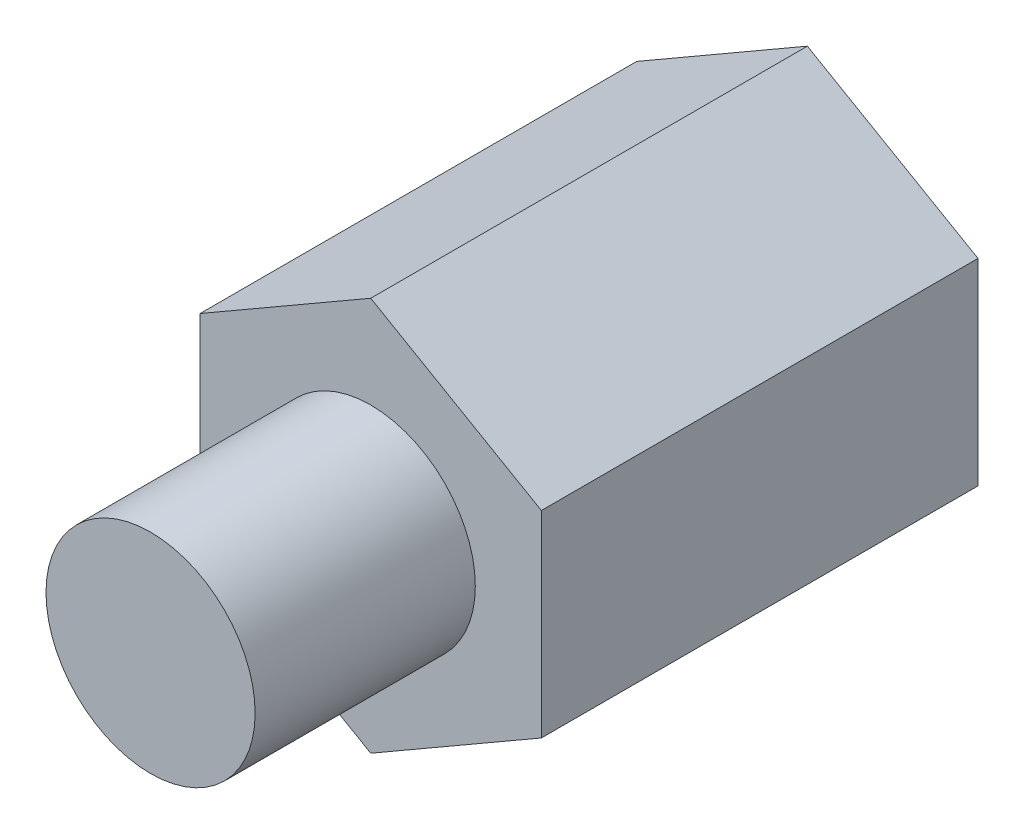
ISO-10303-21;
HEADER;
FILE_DESCRIPTION(('STEP AP214'),'2;1');
FILE_NAME('part.step','',(''),(''),'','','');
FILE_SCHEMA(('AUTOMOTIVE_DESIGN { 1 0 10303 214 1 1 1 1 }'));
ENDSEC;
DATA;
#1=APPLICATION_CONTEXT('core data for automotive mechanical design processes');
#2=APPLICATION_PROTOCOL_DEFINITION('international standard','automotive_design',2000,#1);
#3=PRODUCT_CONTEXT('',#1,'mechanical');
#4=PRODUCT('Part','Part','',(#3));
#5=PRODUCT_RELATED_PRODUCT_CATEGORY('part','',(#4));
#6=PRODUCT_DEFINITION_FORMATION('','',#4);
#7=PRODUCT_DEFINITION_CONTEXT('part definition',#1,'design');
#8=PRODUCT_DEFINITION('design','',#6,#7);
#9=PRODUCT_DEFINITION_SHAPE('','',#8);
#10=(LENGTH_UNIT() NAMED_UNIT(*) SI_UNIT(.MILLI.,.METRE.));
#11=(NAMED_UNIT(*) PLANE_ANGLE_UNIT() SI_UNIT($,.RADIAN.));
#12=(NAMED_UNIT(*) SI_UNIT($,.STERADIAN.) SOLID_ANGLE_UNIT());
#13=UNCERTAINTY_MEASURE_WITH_UNIT(LENGTH_MEASURE(1.E-05),#10,'distance_accuracy_value','');
#14=(GEOMETRIC_REPRESENTATION_CONTEXT(3) GLOBAL_UNCERTAINTY_ASSIGNED_CONTEXT((#13)) GLOBAL_UNIT_ASSIGNED_CONTEXT((#10,
#11,#12)) REPRESENTATION_CONTEXT('',''));
#15=CARTESIAN_POINT('',(0.,0.,0.));
#16=DIRECTION('',(0.,0.,1.));
#17=DIRECTION('',(1.,0.,0.));
#18=AXIS2_PLACEMENT_3D('',#15,#16,#17);
#19=CARTESIAN_POINT('',(0.,0.,5.95));
#20=DIRECTION('',(0.,0.,1.));
#21=DIRECTION('',(1.,0.,0.));
#22=AXIS2_PLACEMENT_3D('',#19,#20,#21);
#23=PLANE('',#22);
#24=CARTESIAN_POINT('',(0.,0.,5.95));
#25=DIRECTION('',(0.,0.,1.));
#26=DIRECTION('',(1.,0.,0.));
#27=AXIS2_PLACEMENT_3D('',#24,#25,#26);
#28=CIRCLE('',#27,1.425);
#29=CARTESIAN_POINT('',(1.425,0.,5.95));
#30=VERTEX_POINT('',#29);
#31=EDGE_CURVE('E185',#30,#30,#28,.T.);
#32=ORIENTED_EDGE('',*,*,#31,.F.);
#33=EDGE_LOOP('',(#32));
#34=FACE_BOUND('',#33,.T.);
#35=DIRECTION('',(0.866025403784441,-0.499999999999995,0.));
#36=VECTOR('',#35,1.);
#37=CARTESIAN_POINT('',(-2.32499999999999,-1.34233937586591,5.95));
#38=LINE('',#37,#36);
#39=CARTESIAN_POINT('',(-2.32499999999999,-1.34233937586591,5.95));
#40=VERTEX_POINT('',#39);
#41=CARTESIAN_POINT('',(0.,-2.68467875173176,5.95));
#42=VERTEX_POINT('',#41);
#43=EDGE_CURVE('E131',#40,#42,#38,.T.);
#44=ORIENTED_EDGE('',*,*,#43,.T.);
#45=DIRECTION('',(0.866025403784438,0.500000000000001,0.));
#46=VECTOR('',#45,1.);
#47=CARTESIAN_POINT('',(0.,-2.68467875173176,5.95));
#48=LINE('',#47,#46);
#49=CARTESIAN_POINT('',(2.32500000000001,-1.34233937586588,5.95));
#50=VERTEX_POINT('',#49);
#51=EDGE_CURVE('E90',#42,#50,#48,.T.);
#52=ORIENTED_EDGE('',*,*,#51,.T.);
#53=DIRECTION('',(0.,1.,0.));
#54=VECTOR('',#53,1.);
#55=CARTESIAN_POINT('',(2.32500000000001,-1.34233937586588,5.95));
#56=LINE('',#55,#54);
#57=CARTESIAN_POINT('',(2.325,1.34233937586589,5.95));
#58=VERTEX_POINT('',#57);
#59=EDGE_CURVE('E102',#50,#58,#56,.T.);
#60=ORIENTED_EDGE('',*,*,#59,.T.);
#61=DIRECTION('',(-0.866025403784442,0.499999999999995,0.));
#62=VECTOR('',#61,1.);
#63=CARTESIAN_POINT('',(2.325,1.34233937586589,5.95));
#64=LINE('',#63,#62);
#65=CARTESIAN_POINT('',(0.,2.68467875173176,5.95));
#66=VERTEX_POINT('',#65);
#67=EDGE_CURVE('E97',#58,#66,#64,.T.);
#68=ORIENTED_EDGE('',*,*,#67,.T.);
#69=DIRECTION('',(-0.866025403784435,-0.500000000000007,0.));
#70=VECTOR('',#69,1.);
#71=CARTESIAN_POINT('',(0.,2.68467875173176,5.95));
#72=LINE('',#71,#70);
#73=CARTESIAN_POINT('',(-2.32500000000001,1.34233937586586,5.95));
#74=VERTEX_POINT('',#73);
#75=EDGE_CURVE('E100',#66,#74,#72,.T.);
#76=ORIENTED_EDGE('',*,*,#75,.T.);
#77=DIRECTION('',(0.,-1.,0.));
#78=VECTOR('',#77,1.);
#79=CARTESIAN_POINT('',(-2.32500000000001,1.34233937586586,5.95));
#80=LINE('',#79,#78);
#81=EDGE_CURVE('E53',#74,#40,#80,.T.);
#82=ORIENTED_EDGE('',*,*,#81,.T.);
#83=EDGE_LOOP('',(#44,#52,#60,#68,#76,#82));
#84=FACE_BOUND('',#83,.T.);
#85=ADVANCED_FACE('F36',(#34,#84),#23,.T.);
#86=CARTESIAN_POINT('',(0.,0.,0.));
#87=DIRECTION('',(0.,0.,1.));
#88=DIRECTION('',(1.,0.,0.));
#89=AXIS2_PLACEMENT_3D('',#86,#87,#88);
#90=PLANE('',#89);
#91=DIRECTION('',(0.866025403784441,-0.499999999999995,0.));
#92=VECTOR('',#91,1.);
#93=CARTESIAN_POINT('',(-2.32499999999999,-1.34233937586591,0.));
#94=LINE('',#93,#92);
#95=CARTESIAN_POINT('',(-2.32499999999999,-1.34233937586591,0.));
#96=VERTEX_POINT('',#95);
#97=CARTESIAN_POINT('',(0.,-2.68467875173176,0.));
#98=VERTEX_POINT('',#97);
#99=EDGE_CURVE('E120',#96,#98,#94,.T.);
#100=ORIENTED_EDGE('',*,*,#99,.F.);
#101=DIRECTION('',(0.,-1.,0.));
#102=VECTOR('',#101,1.);
#103=CARTESIAN_POINT('',(-2.32500000000001,1.34233937586586,0.));
#104=LINE('',#103,#102);
#105=CARTESIAN_POINT('',(-2.32500000000001,1.34233937586586,0.));
#106=VERTEX_POINT('',#105);
#107=EDGE_CURVE('E82',#106,#96,#104,.T.);
#108=ORIENTED_EDGE('',*,*,#107,.F.);
#109=DIRECTION('',(-0.866025403784435,-0.500000000000007,0.));
#110=VECTOR('',#109,1.);
#111=CARTESIAN_POINT('',(0.,2.68467875173176,0.));
#112=LINE('',#111,#110);
#113=CARTESIAN_POINT('',(0.,2.68467875173176,0.));
#114=VERTEX_POINT('',#113);
#115=EDGE_CURVE('E76',#114,#106,#112,.T.);
#116=ORIENTED_EDGE('',*,*,#115,.F.);
#117=DIRECTION('',(-0.866025403784442,0.499999999999995,0.));
#118=VECTOR('',#117,1.);
#119=CARTESIAN_POINT('',(2.325,1.34233937586589,0.));
#120=LINE('',#119,#118);
#121=CARTESIAN_POINT('',(2.325,1.34233937586589,0.));
#122=VERTEX_POINT('',#121);
#123=EDGE_CURVE('E110',#122,#114,#120,.T.);
#124=ORIENTED_EDGE('',*,*,#123,.F.);
#125=DIRECTION('',(0.,1.,0.));
#126=VECTOR('',#125,1.);
#127=CARTESIAN_POINT('',(2.32500000000001,-1.34233937586588,0.));
#128=LINE('',#127,#126);
#129=CARTESIAN_POINT('',(2.32500000000001,-1.34233937586588,0.));
#130=VERTEX_POINT('',#129);
#131=EDGE_CURVE('E126',#130,#122,#128,.T.);
#132=ORIENTED_EDGE('',*,*,#131,.F.);
#133=DIRECTION('',(0.866025403784438,0.500000000000001,0.));
#134=VECTOR('',#133,1.);
#135=CARTESIAN_POINT('',(0.,-2.68467875173176,0.));
#136=LINE('',#135,#134);
#137=EDGE_CURVE('E123',#98,#130,#136,.T.);
#138=ORIENTED_EDGE('',*,*,#137,.F.);
#139=EDGE_LOOP('',(#100,#108,#116,#124,#132,#138));
#140=FACE_BOUND('',#139,.T.);
#141=CARTESIAN_POINT('',(0.,0.,0.));
#142=DIRECTION('',(0.,0.,1.));
#143=DIRECTION('',(1.,0.,0.));
#144=AXIS2_PLACEMENT_3D('',#141,#142,#143);
#145=CIRCLE('',#144,1.2);
#146=CARTESIAN_POINT('',(1.2,0.,0.));
#147=VERTEX_POINT('',#146);
#148=EDGE_CURVE('E124',#147,#147,#145,.T.);
#149=ORIENTED_EDGE('',*,*,#148,.T.);
#150=EDGE_LOOP('',(#149));
#151=FACE_BOUND('',#150,.T.);
#152=ADVANCED_FACE('F140',(#140,#151),#90,.F.);
#153=CARTESIAN_POINT('',(-2.32499999999999,-1.34233937586591,5.95));
#154=DIRECTION('',(0.499999999999995,0.866025403784442,0.));
#155=DIRECTION('',(-0.866025403784442,0.499999999999995,0.));
#156=AXIS2_PLACEMENT_3D('',#153,#154,#155);
#157=PLANE('',#156);
#158=ORIENTED_EDGE('',*,*,#99,.T.);
#159=DIRECTION('',(0.,0.,-1.));
#160=VECTOR('',#159,1.);
#161=CARTESIAN_POINT('',(0.,-2.68467875173176,5.95));
#162=LINE('',#161,#160);
#163=EDGE_CURVE('E11',#42,#98,#162,.T.);
#164=ORIENTED_EDGE('',*,*,#163,.F.);
#165=ORIENTED_EDGE('',*,*,#43,.F.);
#166=DIRECTION('',(0.,0.,-1.));
#167=VECTOR('',#166,1.);
#168=CARTESIAN_POINT('',(-2.32499999999999,-1.34233937586591,5.95));
#169=LINE('',#168,#167);
#170=EDGE_CURVE('E116',#40,#96,#169,.T.);
#171=ORIENTED_EDGE('',*,*,#170,.T.);
#172=EDGE_LOOP('',(#158,#164,#165,#171));
#173=FACE_BOUND('',#172,.T.);
#174=ADVANCED_FACE('F38',(#173),#157,.F.);
#175=CARTESIAN_POINT('',(0.,-2.68467875173176,5.95));
#176=DIRECTION('',(-0.500000000000001,0.866025403784438,0.));
#177=DIRECTION('',(-0.866025403784438,-0.500000000000001,0.));
#178=AXIS2_PLACEMENT_3D('',#175,#176,#177);
#179=PLANE('',#178);
#180=ORIENTED_EDGE('',*,*,#137,.T.);
#181=DIRECTION('',(0.,0.,-1.));
#182=VECTOR('',#181,1.);
#183=CARTESIAN_POINT('',(2.32500000000001,-1.34233937586588,5.95));
#184=LINE('',#183,#182);
#185=EDGE_CURVE('E45',#50,#130,#184,.T.);
#186=ORIENTED_EDGE('',*,*,#185,.F.);
#187=ORIENTED_EDGE('',*,*,#51,.F.);
#188=ORIENTED_EDGE('',*,*,#163,.T.);
#189=EDGE_LOOP('',(#180,#186,#187,#188));
#190=FACE_BOUND('',#189,.T.);
#191=ADVANCED_FACE('F253',(#190),#179,.F.);
#192=CARTESIAN_POINT('',(2.32500000000001,-1.34233937586588,5.95));
#193=DIRECTION('',(-1.,0.,0.));
#194=DIRECTION('',(0.,-1.,0.));
#195=AXIS2_PLACEMENT_3D('',#192,#193,#194);
#196=PLANE('',#195);
#197=ORIENTED_EDGE('',*,*,#131,.T.);
#198=DIRECTION('',(0.,0.,-1.));
#199=VECTOR('',#198,1.);
#200=CARTESIAN_POINT('',(2.325,1.34233937586589,5.95));
#201=LINE('',#200,#199);
#202=EDGE_CURVE('E111',#58,#122,#201,.T.);
#203=ORIENTED_EDGE('',*,*,#202,.F.);
#204=ORIENTED_EDGE('',*,*,#59,.F.);
#205=ORIENTED_EDGE('',*,*,#185,.T.);
#206=EDGE_LOOP('',(#197,#203,#204,#205));
#207=FACE_BOUND('',#206,.T.);
#208=ADVANCED_FACE('F137',(#207),#196,.F.);
#209=CARTESIAN_POINT('',(2.325,1.34233937586589,5.95));
#210=DIRECTION('',(-0.499999999999995,-0.866025403784442,0.));
#211=DIRECTION('',(0.866025403784442,-0.499999999999995,0.));
#212=AXIS2_PLACEMENT_3D('',#209,#210,#211);
#213=PLANE('',#212);
#214=ORIENTED_EDGE('',*,*,#123,.T.);
#215=DIRECTION('',(0.,0.,-1.));
#216=VECTOR('',#215,1.);
#217=CARTESIAN_POINT('',(0.,2.68467875173176,5.95));
#218=LINE('',#217,#216);
#219=EDGE_CURVE('E107',#66,#114,#218,.T.);
#220=ORIENTED_EDGE('',*,*,#219,.F.);
#221=ORIENTED_EDGE('',*,*,#67,.F.);
#222=ORIENTED_EDGE('',*,*,#202,.T.);
#223=EDGE_LOOP('',(#214,#220,#221,#222));
#224=FACE_BOUND('',#223,.T.);
#225=ADVANCED_FACE('F108',(#224),#213,.F.);
#226=CARTESIAN_POINT('',(0.,2.68467875173176,5.95));
#227=DIRECTION('',(0.500000000000007,-0.866025403784435,0.));
#228=DIRECTION('',(0.866025403784435,0.500000000000007,0.));
#229=AXIS2_PLACEMENT_3D('',#226,#227,#228);
#230=PLANE('',#229);
#231=ORIENTED_EDGE('',*,*,#115,.T.);
#232=DIRECTION('',(0.,0.,-1.));
#233=VECTOR('',#232,1.);
#234=CARTESIAN_POINT('',(-2.32500000000001,1.34233937586586,5.95));
#235=LINE('',#234,#233);
#236=EDGE_CURVE('E112',#74,#106,#235,.T.);
#237=ORIENTED_EDGE('',*,*,#236,.F.);
#238=ORIENTED_EDGE('',*,*,#75,.F.);
#239=ORIENTED_EDGE('',*,*,#219,.T.);
#240=EDGE_LOOP('',(#231,#237,#238,#239));
#241=FACE_BOUND('',#240,.T.);
#242=ADVANCED_FACE('F114',(#241),#230,.F.);
#243=CARTESIAN_POINT('',(-2.32500000000001,1.34233937586586,5.95));
#244=DIRECTION('',(1.,0.,0.));
#245=DIRECTION('',(0.,1.,0.));
#246=AXIS2_PLACEMENT_3D('',#243,#244,#245);
#247=PLANE('',#246);
#248=ORIENTED_EDGE('',*,*,#107,.T.);
#249=ORIENTED_EDGE('',*,*,#170,.F.);
#250=ORIENTED_EDGE('',*,*,#81,.F.);
#251=ORIENTED_EDGE('',*,*,#236,.T.);
#252=EDGE_LOOP('',(#248,#249,#250,#251));
#253=FACE_BOUND('',#252,.T.);
#254=ADVANCED_FACE('F145',(#253),#247,.F.);
#255=CARTESIAN_POINT('',(0.,0.,5.95));
#256=DIRECTION('',(0.,0.,-1.));
#257=DIRECTION('',(-1.,0.,0.));
#258=AXIS2_PLACEMENT_3D('',#255,#256,#257);
#259=CYLINDRICAL_SURFACE('',#258,1.2);
#260=CARTESIAN_POINT('',(0.,0.,5.95));
#261=DIRECTION('',(0.,0.,1.));
#262=DIRECTION('',(1.,0.,0.));
#263=AXIS2_PLACEMENT_3D('',#260,#261,#262);
#264=CIRCLE('',#263,1.2);
#265=CARTESIAN_POINT('',(1.2,0.,5.95));
#266=VERTEX_POINT('',#265);
#267=EDGE_CURVE('E184',#266,#266,#264,.T.);
#268=ORIENTED_EDGE('',*,*,#267,.T.);
#269=EDGE_LOOP('',(#268));
#270=FACE_BOUND('',#269,.T.);
#271=ORIENTED_EDGE('',*,*,#148,.F.);
#272=EDGE_LOOP('',(#271));
#273=FACE_BOUND('',#272,.T.);
#274=ADVANCED_FACE('F147',(#270,#273),#259,.F.);
#275=CARTESIAN_POINT('',(0.,0.,5.95));
#276=DIRECTION('',(0.,0.,1.));
#277=DIRECTION('',(1.,0.,0.));
#278=AXIS2_PLACEMENT_3D('',#275,#276,#277);
#279=PLANE('',#278);
#280=ORIENTED_EDGE('',*,*,#267,.F.);
#281=EDGE_LOOP('',(#280));
#282=FACE_BOUND('',#281,.T.);
#283=ADVANCED_FACE('F154',(#282),#279,.F.);
#284=CARTESIAN_POINT('',(0.,0.,8.95));
#285=DIRECTION('',(0.,0.,-1.));
#286=DIRECTION('',(-1.,0.,0.));
#287=AXIS2_PLACEMENT_3D('',#284,#285,#286);
#288=CYLINDRICAL_SURFACE('',#287,1.425);
#289=CARTESIAN_POINT('',(0.,0.,8.95));
#290=DIRECTION('',(0.,0.,1.));
#291=DIRECTION('',(1.,0.,0.));
#292=AXIS2_PLACEMENT_3D('',#289,#290,#291);
#293=CIRCLE('',#292,1.425);
#294=CARTESIAN_POINT('',(1.425,0.,8.95));
#295=VERTEX_POINT('',#294);
#296=EDGE_CURVE('E183',#295,#295,#293,.T.);
#297=ORIENTED_EDGE('',*,*,#296,.F.);
#298=EDGE_LOOP('',(#297));
#299=FACE_BOUND('',#298,.T.);
#300=ORIENTED_EDGE('',*,*,#31,.T.);
#301=EDGE_LOOP('',(#300));
#302=FACE_BOUND('',#301,.T.);
#303=ADVANCED_FACE('F169',(#299,#302),#288,.T.);
#304=CARTESIAN_POINT('',(0.,0.,8.95));
#305=DIRECTION('',(0.,0.,1.));
#306=DIRECTION('',(1.,0.,0.));
#307=AXIS2_PLACEMENT_3D('',#304,#305,#306);
#308=PLANE('',#307);
#309=ORIENTED_EDGE('',*,*,#296,.T.);
#310=EDGE_LOOP('',(#309));
#311=FACE_BOUND('',#310,.T.);
#312=ADVANCED_FACE('F172',(#311),#308,.T.);
#313=CLOSED_SHELL('',(#85,#152,#174,#191,#208,#225,#242,#254,#274,#283,#303,#312));
#314=MANIFOLD_SOLID_BREP('B2',#313);
#315=ADVANCED_BREP_SHAPE_REPRESENTATION('',(#18,#314),#14);
#316=SHAPE_DEFINITION_REPRESENTATION(#9,#315);
ENDSEC;
END-ISO-10303-21;
